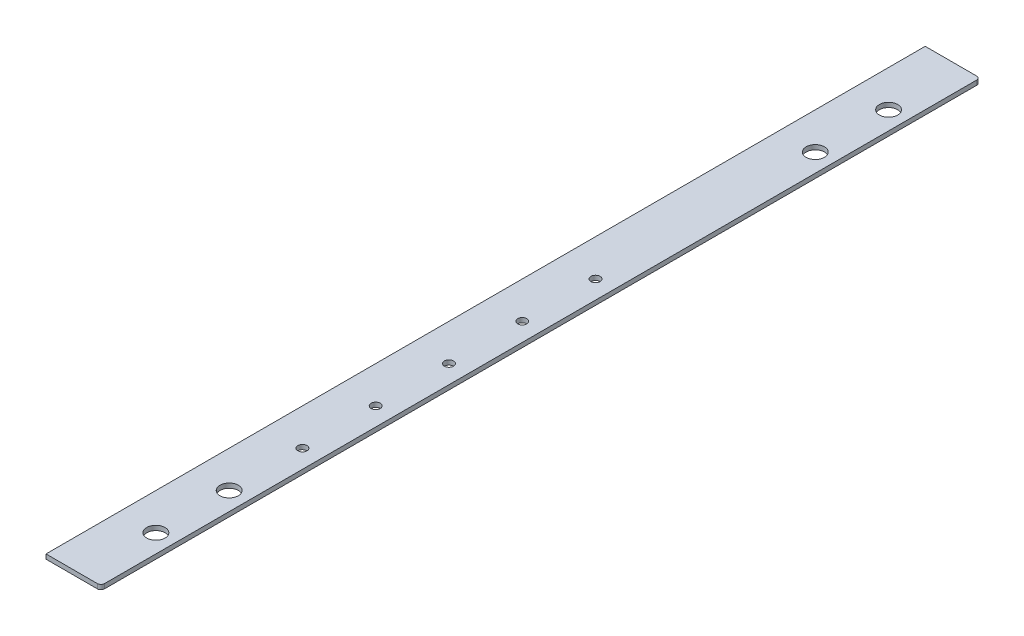
ISO-10303-21;
HEADER;
FILE_DESCRIPTION(('STEP AP214'),'2;1');
FILE_NAME('part.step','',(''),(''),'','','');
FILE_SCHEMA(('AUTOMOTIVE_DESIGN { 1 0 10303 214 1 1 1 1 }'));
ENDSEC;
DATA;
#1=APPLICATION_CONTEXT('core data for automotive mechanical design processes');
#2=APPLICATION_PROTOCOL_DEFINITION('international standard','automotive_design',2000,#1);
#3=PRODUCT_CONTEXT('',#1,'mechanical');
#4=PRODUCT('Part','Part','',(#3));
#5=PRODUCT_RELATED_PRODUCT_CATEGORY('part','',(#4));
#6=PRODUCT_DEFINITION_FORMATION('','',#4);
#7=PRODUCT_DEFINITION_CONTEXT('part definition',#1,'design');
#8=PRODUCT_DEFINITION('design','',#6,#7);
#9=PRODUCT_DEFINITION_SHAPE('','',#8);
#10=(LENGTH_UNIT() NAMED_UNIT(*) SI_UNIT(.MILLI.,.METRE.));
#11=(NAMED_UNIT(*) PLANE_ANGLE_UNIT() SI_UNIT($,.RADIAN.));
#12=(NAMED_UNIT(*) SI_UNIT($,.STERADIAN.) SOLID_ANGLE_UNIT());
#13=UNCERTAINTY_MEASURE_WITH_UNIT(LENGTH_MEASURE(1.E-05),#10,'distance_accuracy_value','');
#14=(GEOMETRIC_REPRESENTATION_CONTEXT(3) GLOBAL_UNCERTAINTY_ASSIGNED_CONTEXT((#13)) GLOBAL_UNIT_ASSIGNED_CONTEXT((#10,
#11,#12)) REPRESENTATION_CONTEXT('',''));
#15=CARTESIAN_POINT('',(0.,0.,0.));
#16=DIRECTION('',(0.,0.,1.));
#17=DIRECTION('',(1.,0.,0.));
#18=AXIS2_PLACEMENT_3D('',#15,#16,#17);
#19=CARTESIAN_POINT('',(0.,3.175,0.));
#20=DIRECTION('',(1.,0.,0.));
#21=DIRECTION('',(0.,0.,-1.));
#22=AXIS2_PLACEMENT_3D('',#19,#20,#21);
#23=PLANE('',#22);
#24=DIRECTION('',(0.,0.,1.));
#25=VECTOR('',#24,1.);
#26=CARTESIAN_POINT('',(0.,0.,0.));
#27=LINE('',#26,#25);
#28=CARTESIAN_POINT('',(-1.11022302462516E-13,0.,-609.6));
#29=VERTEX_POINT('',#28);
#30=CARTESIAN_POINT('',(0.,0.,0.));
#31=VERTEX_POINT('',#30);
#32=EDGE_CURVE('E105',#29,#31,#27,.T.);
#33=ORIENTED_EDGE('',*,*,#32,.T.);
#34=DIRECTION('',(0.,-1.,0.));
#35=VECTOR('',#34,1.);
#36=CARTESIAN_POINT('',(0.,3.175,0.));
#37=LINE('',#36,#35);
#38=CARTESIAN_POINT('',(0.,3.175,0.));
#39=VERTEX_POINT('',#38);
#40=EDGE_CURVE('E90',#39,#31,#37,.T.);
#41=ORIENTED_EDGE('',*,*,#40,.F.);
#42=DIRECTION('',(0.,0.,1.));
#43=VECTOR('',#42,1.);
#44=CARTESIAN_POINT('',(0.,3.175,0.));
#45=LINE('',#44,#43);
#46=CARTESIAN_POINT('',(-1.11022302462516E-13,3.175,-609.6));
#47=VERTEX_POINT('',#46);
#48=EDGE_CURVE('E94',#47,#39,#45,.T.);
#49=ORIENTED_EDGE('',*,*,#48,.F.);
#50=DIRECTION('',(0.,-1.,0.));
#51=VECTOR('',#50,1.);
#52=CARTESIAN_POINT('',(-1.11022302462516E-13,3.175,-609.6));
#53=LINE('',#52,#51);
#54=EDGE_CURVE('E107',#47,#29,#53,.T.);
#55=ORIENTED_EDGE('',*,*,#54,.T.);
#56=EDGE_LOOP('',(#33,#41,#49,#55));
#57=FACE_BOUND('',#56,.T.);
#58=ADVANCED_FACE('F33',(#57),#23,.F.);
#59=CARTESIAN_POINT('',(0.,3.175,0.));
#60=DIRECTION('',(0.,0.,-1.));
#61=DIRECTION('',(-1.,0.,0.));
#62=AXIS2_PLACEMENT_3D('',#59,#60,#61);
#63=PLANE('',#62);
#64=DIRECTION('',(1.,0.,0.));
#65=VECTOR('',#64,1.);
#66=CARTESIAN_POINT('',(0.,0.,0.));
#67=LINE('',#66,#65);
#68=CARTESIAN_POINT('',(35.56,0.,0.));
#69=VERTEX_POINT('',#68);
#70=EDGE_CURVE('E133',#31,#69,#67,.T.);
#71=ORIENTED_EDGE('',*,*,#70,.T.);
#72=DIRECTION('',(0.,-1.,0.));
#73=VECTOR('',#72,1.);
#74=CARTESIAN_POINT('',(35.56,3.175,0.));
#75=LINE('',#74,#73);
#76=CARTESIAN_POINT('',(35.56,3.175,0.));
#77=VERTEX_POINT('',#76);
#78=EDGE_CURVE('E56',#69,#77,#75,.F.);
#79=ORIENTED_EDGE('',*,*,#78,.T.);
#80=DIRECTION('',(1.,0.,0.));
#81=VECTOR('',#80,1.);
#82=CARTESIAN_POINT('',(0.,3.175,0.));
#83=LINE('',#82,#81);
#84=EDGE_CURVE('E86',#39,#77,#83,.T.);
#85=ORIENTED_EDGE('',*,*,#84,.F.);
#86=ORIENTED_EDGE('',*,*,#40,.T.);
#87=EDGE_LOOP('',(#71,#79,#85,#86));
#88=FACE_BOUND('',#87,.T.);
#89=ADVANCED_FACE('F88',(#88),#63,.F.);
#90=CARTESIAN_POINT('',(38.1,3.175,0.));
#91=DIRECTION('',(-1.,0.,0.));
#92=DIRECTION('',(0.,0.,1.));
#93=AXIS2_PLACEMENT_3D('',#90,#91,#92);
#94=PLANE('',#93);
#95=DIRECTION('',(0.,0.,-1.));
#96=VECTOR('',#95,1.);
#97=CARTESIAN_POINT('',(38.1,3.175,0.));
#98=LINE('',#97,#96);
#99=CARTESIAN_POINT('',(38.1,3.175,-2.54));
#100=VERTEX_POINT('',#99);
#101=CARTESIAN_POINT('',(38.0999999999999,3.175,-607.06));
#102=VERTEX_POINT('',#101);
#103=EDGE_CURVE('E93',#100,#102,#98,.T.);
#104=ORIENTED_EDGE('',*,*,#103,.F.);
#105=DIRECTION('',(0.,-1.,0.));
#106=VECTOR('',#105,1.);
#107=CARTESIAN_POINT('',(38.1,3.175,-2.54));
#108=LINE('',#107,#106);
#109=CARTESIAN_POINT('',(38.1,0.,-2.54));
#110=VERTEX_POINT('',#109);
#111=EDGE_CURVE('E109',#100,#110,#108,.T.);
#112=ORIENTED_EDGE('',*,*,#111,.T.);
#113=DIRECTION('',(0.,0.,-1.));
#114=VECTOR('',#113,1.);
#115=CARTESIAN_POINT('',(38.1,0.,0.));
#116=LINE('',#115,#114);
#117=CARTESIAN_POINT('',(38.0999999999999,0.,-607.06));
#118=VERTEX_POINT('',#117);
#119=EDGE_CURVE('E134',#110,#118,#116,.T.);
#120=ORIENTED_EDGE('',*,*,#119,.T.);
#121=DIRECTION('',(0.,-1.,0.));
#122=VECTOR('',#121,1.);
#123=CARTESIAN_POINT('',(38.0999999999999,3.175,-607.06));
#124=LINE('',#123,#122);
#125=EDGE_CURVE('E106',#118,#102,#124,.F.);
#126=ORIENTED_EDGE('',*,*,#125,.T.);
#127=EDGE_LOOP('',(#104,#112,#120,#126));
#128=FACE_BOUND('',#127,.T.);
#129=ADVANCED_FACE('F125',(#128),#94,.F.);
#130=CARTESIAN_POINT('',(-1.11022302462516E-13,3.175,-609.6));
#131=DIRECTION('',(0.,0.,1.));
#132=DIRECTION('',(1.,0.,0.));
#133=AXIS2_PLACEMENT_3D('',#130,#131,#132);
#134=PLANE('',#133);
#135=DIRECTION('',(-1.,0.,0.));
#136=VECTOR('',#135,1.);
#137=CARTESIAN_POINT('',(-1.11022302462516E-13,3.175,-609.6));
#138=LINE('',#137,#136);
#139=CARTESIAN_POINT('',(35.5599999999999,3.175,-609.6));
#140=VERTEX_POINT('',#139);
#141=EDGE_CURVE('E98',#140,#47,#138,.T.);
#142=ORIENTED_EDGE('',*,*,#141,.F.);
#143=DIRECTION('',(0.,-1.,0.));
#144=VECTOR('',#143,1.);
#145=CARTESIAN_POINT('',(35.5599999999999,3.175,-609.6));
#146=LINE('',#145,#144);
#147=CARTESIAN_POINT('',(35.5599999999999,0.,-609.6));
#148=VERTEX_POINT('',#147);
#149=EDGE_CURVE('E11',#140,#148,#146,.T.);
#150=ORIENTED_EDGE('',*,*,#149,.T.);
#151=DIRECTION('',(-1.,0.,0.));
#152=VECTOR('',#151,1.);
#153=CARTESIAN_POINT('',(-1.11022302462516E-13,0.,-609.6));
#154=LINE('',#153,#152);
#155=EDGE_CURVE('E102',#148,#29,#154,.T.);
#156=ORIENTED_EDGE('',*,*,#155,.T.);
#157=ORIENTED_EDGE('',*,*,#54,.F.);
#158=EDGE_LOOP('',(#142,#150,#156,#157));
#159=FACE_BOUND('',#158,.T.);
#160=ADVANCED_FACE('F142',(#159),#134,.F.);
#161=CARTESIAN_POINT('',(-1.11022302462516E-13,3.175,-609.6));
#162=DIRECTION('',(0.,-1.,0.));
#163=DIRECTION('',(0.,0.,-1.));
#164=AXIS2_PLACEMENT_3D('',#161,#162,#163);
#165=PLANE('',#164);
#166=CARTESIAN_POINT('',(25.3999999999999,3.175,-508.));
#167=DIRECTION('',(0.,1.,0.));
#168=DIRECTION('',(0.,0.,1.));
#169=AXIS2_PLACEMENT_3D('',#166,#167,#168);
#170=CIRCLE('',#169,6.35);
#171=CARTESIAN_POINT('',(25.3999999999999,3.175,-501.65));
#172=VERTEX_POINT('',#171);
#173=EDGE_CURVE('E209',#172,#172,#170,.T.);
#174=ORIENTED_EDGE('',*,*,#173,.F.);
#175=EDGE_LOOP('',(#174));
#176=FACE_BOUND('',#175,.T.);
#177=CARTESIAN_POINT('',(25.3999999999999,3.175,-558.8));
#178=DIRECTION('',(0.,1.,0.));
#179=DIRECTION('',(0.,0.,1.));
#180=AXIS2_PLACEMENT_3D('',#177,#178,#179);
#181=CIRCLE('',#180,6.35);
#182=CARTESIAN_POINT('',(25.3999999999999,3.175,-552.45));
#183=VERTEX_POINT('',#182);
#184=EDGE_CURVE('E211',#183,#183,#181,.T.);
#185=ORIENTED_EDGE('',*,*,#184,.F.);
#186=EDGE_LOOP('',(#185));
#187=FACE_BOUND('',#186,.T.);
#188=CARTESIAN_POINT('',(25.4,3.175,-101.6));
#189=DIRECTION('',(0.,1.,0.));
#190=DIRECTION('',(0.,0.,1.));
#191=AXIS2_PLACEMENT_3D('',#188,#189,#190);
#192=CIRCLE('',#191,6.35);
#193=CARTESIAN_POINT('',(25.4,3.175,-95.25));
#194=VERTEX_POINT('',#193);
#195=EDGE_CURVE('E217',#194,#194,#192,.T.);
#196=ORIENTED_EDGE('',*,*,#195,.F.);
#197=EDGE_LOOP('',(#196));
#198=FACE_BOUND('',#197,.T.);
#199=CARTESIAN_POINT('',(25.3999999999999,3.175,-355.6));
#200=DIRECTION('',(0.,1.,0.));
#201=DIRECTION('',(0.,0.,1.));
#202=AXIS2_PLACEMENT_3D('',#199,#200,#201);
#203=CIRCLE('',#202,3.175);
#204=CARTESIAN_POINT('',(25.3999999999999,3.175,-352.425));
#205=VERTEX_POINT('',#204);
#206=EDGE_CURVE('E223',#205,#205,#203,.T.);
#207=ORIENTED_EDGE('',*,*,#206,.F.);
#208=EDGE_LOOP('',(#207));
#209=FACE_BOUND('',#208,.T.);
#210=CARTESIAN_POINT('',(25.4,3.175,-304.8));
#211=DIRECTION('',(0.,1.,0.));
#212=DIRECTION('',(0.,0.,1.));
#213=AXIS2_PLACEMENT_3D('',#210,#211,#212);
#214=CIRCLE('',#213,3.175);
#215=CARTESIAN_POINT('',(25.4,3.175,-301.625));
#216=VERTEX_POINT('',#215);
#217=EDGE_CURVE('E229',#216,#216,#214,.T.);
#218=ORIENTED_EDGE('',*,*,#217,.F.);
#219=EDGE_LOOP('',(#218));
#220=FACE_BOUND('',#219,.T.);
#221=CARTESIAN_POINT('',(25.4,3.175,-254.));
#222=DIRECTION('',(0.,1.,0.));
#223=DIRECTION('',(0.,0.,1.));
#224=AXIS2_PLACEMENT_3D('',#221,#222,#223);
#225=CIRCLE('',#224,3.175);
#226=CARTESIAN_POINT('',(25.4,3.175,-250.825));
#227=VERTEX_POINT('',#226);
#228=EDGE_CURVE('E235',#227,#227,#225,.T.);
#229=ORIENTED_EDGE('',*,*,#228,.F.);
#230=EDGE_LOOP('',(#229));
#231=FACE_BOUND('',#230,.T.);
#232=CARTESIAN_POINT('',(25.4,3.175,-203.2));
#233=DIRECTION('',(0.,1.,0.));
#234=DIRECTION('',(0.,0.,1.));
#235=AXIS2_PLACEMENT_3D('',#232,#233,#234);
#236=CIRCLE('',#235,3.175);
#237=CARTESIAN_POINT('',(25.4,3.175,-200.025));
#238=VERTEX_POINT('',#237);
#239=EDGE_CURVE('E241',#238,#238,#236,.T.);
#240=ORIENTED_EDGE('',*,*,#239,.F.);
#241=EDGE_LOOP('',(#240));
#242=FACE_BOUND('',#241,.T.);
#243=CARTESIAN_POINT('',(25.4,3.175,-152.4));
#244=DIRECTION('',(0.,1.,0.));
#245=DIRECTION('',(0.,0.,1.));
#246=AXIS2_PLACEMENT_3D('',#243,#244,#245);
#247=CIRCLE('',#246,3.175);
#248=CARTESIAN_POINT('',(25.4,3.175,-149.225));
#249=VERTEX_POINT('',#248);
#250=EDGE_CURVE('E247',#249,#249,#247,.T.);
#251=ORIENTED_EDGE('',*,*,#250,.F.);
#252=EDGE_LOOP('',(#251));
#253=FACE_BOUND('',#252,.T.);
#254=CARTESIAN_POINT('',(25.4,3.175,-50.8));
#255=DIRECTION('',(0.,1.,0.));
#256=DIRECTION('',(0.,0.,1.));
#257=AXIS2_PLACEMENT_3D('',#254,#255,#256);
#258=CIRCLE('',#257,6.35);
#259=CARTESIAN_POINT('',(25.4,3.175,-44.45));
#260=VERTEX_POINT('',#259);
#261=EDGE_CURVE('E253',#260,#260,#258,.T.);
#262=ORIENTED_EDGE('',*,*,#261,.F.);
#263=EDGE_LOOP('',(#262));
#264=FACE_BOUND('',#263,.T.);
#265=ORIENTED_EDGE('',*,*,#84,.T.);
#266=CARTESIAN_POINT('',(35.56,3.175,-2.54));
#267=DIRECTION('',(0.,-1.,0.));
#268=DIRECTION('',(0.,0.,-1.));
#269=AXIS2_PLACEMENT_3D('',#266,#267,#268);
#270=CIRCLE('',#269,2.54);
#271=EDGE_CURVE('E41',#77,#100,#270,.F.);
#272=ORIENTED_EDGE('',*,*,#271,.T.);
#273=ORIENTED_EDGE('',*,*,#103,.T.);
#274=CARTESIAN_POINT('',(35.5599999999999,3.175,-607.06));
#275=DIRECTION('',(0.,-1.,0.));
#276=DIRECTION('',(0.,0.,-1.));
#277=AXIS2_PLACEMENT_3D('',#274,#275,#276);
#278=CIRCLE('',#277,2.54);
#279=EDGE_CURVE('E48',#102,#140,#278,.F.);
#280=ORIENTED_EDGE('',*,*,#279,.T.);
#281=ORIENTED_EDGE('',*,*,#141,.T.);
#282=ORIENTED_EDGE('',*,*,#48,.T.);
#283=EDGE_LOOP('',(#265,#272,#273,#280,#281,#282));
#284=FACE_BOUND('',#283,.T.);
#285=ADVANCED_FACE('F97',(#176,#187,#198,#209,#220,#231,#242,#253,#264,#284),#165,.F.);
#286=CARTESIAN_POINT('',(-1.11022302462516E-13,0.,-609.6));
#287=DIRECTION('',(0.,-1.,0.));
#288=DIRECTION('',(0.,0.,-1.));
#289=AXIS2_PLACEMENT_3D('',#286,#287,#288);
#290=PLANE('',#289);
#291=CARTESIAN_POINT('',(25.3999999999999,0.,-508.));
#292=DIRECTION('',(0.,1.,0.));
#293=DIRECTION('',(0.,0.,1.));
#294=AXIS2_PLACEMENT_3D('',#291,#292,#293);
#295=CIRCLE('',#294,6.35);
#296=CARTESIAN_POINT('',(25.3999999999999,0.,-501.65));
#297=VERTEX_POINT('',#296);
#298=EDGE_CURVE('E206',#297,#297,#295,.T.);
#299=ORIENTED_EDGE('',*,*,#298,.T.);
#300=EDGE_LOOP('',(#299));
#301=FACE_BOUND('',#300,.T.);
#302=CARTESIAN_POINT('',(25.3999999999999,0.,-558.8));
#303=DIRECTION('',(0.,1.,0.));
#304=DIRECTION('',(0.,0.,1.));
#305=AXIS2_PLACEMENT_3D('',#302,#303,#304);
#306=CIRCLE('',#305,6.35);
#307=CARTESIAN_POINT('',(25.3999999999999,0.,-552.45));
#308=VERTEX_POINT('',#307);
#309=EDGE_CURVE('E214',#308,#308,#306,.T.);
#310=ORIENTED_EDGE('',*,*,#309,.T.);
#311=EDGE_LOOP('',(#310));
#312=FACE_BOUND('',#311,.T.);
#313=CARTESIAN_POINT('',(25.4,0.,-101.6));
#314=DIRECTION('',(0.,1.,0.));
#315=DIRECTION('',(0.,0.,1.));
#316=AXIS2_PLACEMENT_3D('',#313,#314,#315);
#317=CIRCLE('',#316,6.35);
#318=CARTESIAN_POINT('',(25.4,0.,-95.25));
#319=VERTEX_POINT('',#318);
#320=EDGE_CURVE('E220',#319,#319,#317,.T.);
#321=ORIENTED_EDGE('',*,*,#320,.T.);
#322=EDGE_LOOP('',(#321));
#323=FACE_BOUND('',#322,.T.);
#324=CARTESIAN_POINT('',(25.3999999999999,0.,-355.6));
#325=DIRECTION('',(0.,1.,0.));
#326=DIRECTION('',(0.,0.,1.));
#327=AXIS2_PLACEMENT_3D('',#324,#325,#326);
#328=CIRCLE('',#327,3.175);
#329=CARTESIAN_POINT('',(25.3999999999999,0.,-352.425));
#330=VERTEX_POINT('',#329);
#331=EDGE_CURVE('E226',#330,#330,#328,.T.);
#332=ORIENTED_EDGE('',*,*,#331,.T.);
#333=EDGE_LOOP('',(#332));
#334=FACE_BOUND('',#333,.T.);
#335=CARTESIAN_POINT('',(25.4,0.,-304.8));
#336=DIRECTION('',(0.,1.,0.));
#337=DIRECTION('',(0.,0.,1.));
#338=AXIS2_PLACEMENT_3D('',#335,#336,#337);
#339=CIRCLE('',#338,3.175);
#340=CARTESIAN_POINT('',(25.4,0.,-301.625));
#341=VERTEX_POINT('',#340);
#342=EDGE_CURVE('E232',#341,#341,#339,.T.);
#343=ORIENTED_EDGE('',*,*,#342,.T.);
#344=EDGE_LOOP('',(#343));
#345=FACE_BOUND('',#344,.T.);
#346=CARTESIAN_POINT('',(25.4,0.,-254.));
#347=DIRECTION('',(0.,1.,0.));
#348=DIRECTION('',(0.,0.,1.));
#349=AXIS2_PLACEMENT_3D('',#346,#347,#348);
#350=CIRCLE('',#349,3.175);
#351=CARTESIAN_POINT('',(25.4,0.,-250.825));
#352=VERTEX_POINT('',#351);
#353=EDGE_CURVE('E238',#352,#352,#350,.T.);
#354=ORIENTED_EDGE('',*,*,#353,.T.);
#355=EDGE_LOOP('',(#354));
#356=FACE_BOUND('',#355,.T.);
#357=CARTESIAN_POINT('',(25.4,0.,-203.2));
#358=DIRECTION('',(0.,1.,0.));
#359=DIRECTION('',(0.,0.,1.));
#360=AXIS2_PLACEMENT_3D('',#357,#358,#359);
#361=CIRCLE('',#360,3.175);
#362=CARTESIAN_POINT('',(25.4,0.,-200.025));
#363=VERTEX_POINT('',#362);
#364=EDGE_CURVE('E244',#363,#363,#361,.T.);
#365=ORIENTED_EDGE('',*,*,#364,.T.);
#366=EDGE_LOOP('',(#365));
#367=FACE_BOUND('',#366,.T.);
#368=CARTESIAN_POINT('',(25.4,0.,-152.4));
#369=DIRECTION('',(0.,1.,0.));
#370=DIRECTION('',(0.,0.,1.));
#371=AXIS2_PLACEMENT_3D('',#368,#369,#370);
#372=CIRCLE('',#371,3.175);
#373=CARTESIAN_POINT('',(25.4,0.,-149.225));
#374=VERTEX_POINT('',#373);
#375=EDGE_CURVE('E250',#374,#374,#372,.T.);
#376=ORIENTED_EDGE('',*,*,#375,.T.);
#377=EDGE_LOOP('',(#376));
#378=FACE_BOUND('',#377,.T.);
#379=CARTESIAN_POINT('',(25.4,0.,-50.8));
#380=DIRECTION('',(0.,1.,0.));
#381=DIRECTION('',(0.,0.,1.));
#382=AXIS2_PLACEMENT_3D('',#379,#380,#381);
#383=CIRCLE('',#382,6.35);
#384=CARTESIAN_POINT('',(25.4,0.,-44.45));
#385=VERTEX_POINT('',#384);
#386=EDGE_CURVE('E137',#385,#385,#383,.T.);
#387=ORIENTED_EDGE('',*,*,#386,.T.);
#388=EDGE_LOOP('',(#387));
#389=FACE_BOUND('',#388,.T.);
#390=ORIENTED_EDGE('',*,*,#119,.F.);
#391=CARTESIAN_POINT('',(35.56,0.,-2.54));
#392=DIRECTION('',(0.,-1.,0.));
#393=DIRECTION('',(0.,0.,-1.));
#394=AXIS2_PLACEMENT_3D('',#391,#392,#393);
#395=CIRCLE('',#394,2.54);
#396=EDGE_CURVE('E118',#110,#69,#395,.T.);
#397=ORIENTED_EDGE('',*,*,#396,.T.);
#398=ORIENTED_EDGE('',*,*,#70,.F.);
#399=ORIENTED_EDGE('',*,*,#32,.F.);
#400=ORIENTED_EDGE('',*,*,#155,.F.);
#401=CARTESIAN_POINT('',(35.5599999999999,0.,-607.06));
#402=DIRECTION('',(0.,-1.,0.));
#403=DIRECTION('',(0.,0.,-1.));
#404=AXIS2_PLACEMENT_3D('',#401,#402,#403);
#405=CIRCLE('',#404,2.54);
#406=EDGE_CURVE('E116',#148,#118,#405,.T.);
#407=ORIENTED_EDGE('',*,*,#406,.T.);
#408=EDGE_LOOP('',(#390,#397,#398,#399,#400,#407));
#409=FACE_BOUND('',#408,.T.);
#410=ADVANCED_FACE('F132',(#301,#312,#323,#334,#345,#356,#367,#378,#389,#409),#290,.T.);
#411=CARTESIAN_POINT('',(35.56,3.175,-2.54));
#412=DIRECTION('',(0.,-1.,0.));
#413=DIRECTION('',(0.,0.,-1.));
#414=AXIS2_PLACEMENT_3D('',#411,#412,#413);
#415=CYLINDRICAL_SURFACE('',#414,2.54);
#416=ORIENTED_EDGE('',*,*,#271,.F.);
#417=ORIENTED_EDGE('',*,*,#78,.F.);
#418=ORIENTED_EDGE('',*,*,#396,.F.);
#419=ORIENTED_EDGE('',*,*,#111,.F.);
#420=EDGE_LOOP('',(#416,#417,#418,#419));
#421=FACE_BOUND('',#420,.T.);
#422=ADVANCED_FACE('F130',(#421),#415,.T.);
#423=CARTESIAN_POINT('',(35.5599999999999,3.175,-607.06));
#424=DIRECTION('',(0.,-1.,0.));
#425=DIRECTION('',(0.,0.,-1.));
#426=AXIS2_PLACEMENT_3D('',#423,#424,#425);
#427=CYLINDRICAL_SURFACE('',#426,2.54);
#428=ORIENTED_EDGE('',*,*,#279,.F.);
#429=ORIENTED_EDGE('',*,*,#125,.F.);
#430=ORIENTED_EDGE('',*,*,#406,.F.);
#431=ORIENTED_EDGE('',*,*,#149,.F.);
#432=EDGE_LOOP('',(#428,#429,#430,#431));
#433=FACE_BOUND('',#432,.T.);
#434=ADVANCED_FACE('F35',(#433),#427,.T.);
#435=CARTESIAN_POINT('',(25.4,0.,-50.8));
#436=DIRECTION('',(0.,1.,0.));
#437=DIRECTION('',(0.,0.,1.));
#438=AXIS2_PLACEMENT_3D('',#435,#436,#437);
#439=CYLINDRICAL_SURFACE('',#438,6.35);
#440=ORIENTED_EDGE('',*,*,#386,.F.);
#441=EDGE_LOOP('',(#440));
#442=FACE_BOUND('',#441,.T.);
#443=ORIENTED_EDGE('',*,*,#261,.T.);
#444=EDGE_LOOP('',(#443));
#445=FACE_BOUND('',#444,.T.);
#446=ADVANCED_FACE('F146',(#442,#445),#439,.F.);
#447=CARTESIAN_POINT('',(25.4,0.,-152.4));
#448=DIRECTION('',(0.,1.,0.));
#449=DIRECTION('',(0.,0.,1.));
#450=AXIS2_PLACEMENT_3D('',#447,#448,#449);
#451=CYLINDRICAL_SURFACE('',#450,3.175);
#452=ORIENTED_EDGE('',*,*,#375,.F.);
#453=EDGE_LOOP('',(#452));
#454=FACE_BOUND('',#453,.T.);
#455=ORIENTED_EDGE('',*,*,#250,.T.);
#456=EDGE_LOOP('',(#455));
#457=FACE_BOUND('',#456,.T.);
#458=ADVANCED_FACE('F151',(#454,#457),#451,.F.);
#459=CARTESIAN_POINT('',(25.4,0.,-203.2));
#460=DIRECTION('',(0.,1.,0.));
#461=DIRECTION('',(0.,0.,1.));
#462=AXIS2_PLACEMENT_3D('',#459,#460,#461);
#463=CYLINDRICAL_SURFACE('',#462,3.175);
#464=ORIENTED_EDGE('',*,*,#364,.F.);
#465=EDGE_LOOP('',(#464));
#466=FACE_BOUND('',#465,.T.);
#467=ORIENTED_EDGE('',*,*,#239,.T.);
#468=EDGE_LOOP('',(#467));
#469=FACE_BOUND('',#468,.T.);
#470=ADVANCED_FACE('F173',(#466,#469),#463,.F.);
#471=CARTESIAN_POINT('',(25.4,0.,-254.));
#472=DIRECTION('',(0.,1.,0.));
#473=DIRECTION('',(0.,0.,1.));
#474=AXIS2_PLACEMENT_3D('',#471,#472,#473);
#475=CYLINDRICAL_SURFACE('',#474,3.175);
#476=ORIENTED_EDGE('',*,*,#353,.F.);
#477=EDGE_LOOP('',(#476));
#478=FACE_BOUND('',#477,.T.);
#479=ORIENTED_EDGE('',*,*,#228,.T.);
#480=EDGE_LOOP('',(#479));
#481=FACE_BOUND('',#480,.T.);
#482=ADVANCED_FACE('F177',(#478,#481),#475,.F.);
#483=CARTESIAN_POINT('',(25.4,0.,-304.8));
#484=DIRECTION('',(0.,1.,0.));
#485=DIRECTION('',(0.,0.,1.));
#486=AXIS2_PLACEMENT_3D('',#483,#484,#485);
#487=CYLINDRICAL_SURFACE('',#486,3.175);
#488=ORIENTED_EDGE('',*,*,#342,.F.);
#489=EDGE_LOOP('',(#488));
#490=FACE_BOUND('',#489,.T.);
#491=ORIENTED_EDGE('',*,*,#217,.T.);
#492=EDGE_LOOP('',(#491));
#493=FACE_BOUND('',#492,.T.);
#494=ADVANCED_FACE('F181',(#490,#493),#487,.F.);
#495=CARTESIAN_POINT('',(25.3999999999999,0.,-355.6));
#496=DIRECTION('',(0.,1.,0.));
#497=DIRECTION('',(0.,0.,1.));
#498=AXIS2_PLACEMENT_3D('',#495,#496,#497);
#499=CYLINDRICAL_SURFACE('',#498,3.175);
#500=ORIENTED_EDGE('',*,*,#331,.F.);
#501=EDGE_LOOP('',(#500));
#502=FACE_BOUND('',#501,.T.);
#503=ORIENTED_EDGE('',*,*,#206,.T.);
#504=EDGE_LOOP('',(#503));
#505=FACE_BOUND('',#504,.T.);
#506=ADVANCED_FACE('F185',(#502,#505),#499,.F.);
#507=CARTESIAN_POINT('',(25.4,0.,-101.6));
#508=DIRECTION('',(0.,1.,0.));
#509=DIRECTION('',(0.,0.,1.));
#510=AXIS2_PLACEMENT_3D('',#507,#508,#509);
#511=CYLINDRICAL_SURFACE('',#510,6.35);
#512=ORIENTED_EDGE('',*,*,#320,.F.);
#513=EDGE_LOOP('',(#512));
#514=FACE_BOUND('',#513,.T.);
#515=ORIENTED_EDGE('',*,*,#195,.T.);
#516=EDGE_LOOP('',(#515));
#517=FACE_BOUND('',#516,.T.);
#518=ADVANCED_FACE('F189',(#514,#517),#511,.F.);
#519=CARTESIAN_POINT('',(25.3999999999999,0.,-558.8));
#520=DIRECTION('',(0.,1.,0.));
#521=DIRECTION('',(0.,0.,1.));
#522=AXIS2_PLACEMENT_3D('',#519,#520,#521);
#523=CYLINDRICAL_SURFACE('',#522,6.35);
#524=ORIENTED_EDGE('',*,*,#309,.F.);
#525=EDGE_LOOP('',(#524));
#526=FACE_BOUND('',#525,.T.);
#527=ORIENTED_EDGE('',*,*,#184,.T.);
#528=EDGE_LOOP('',(#527));
#529=FACE_BOUND('',#528,.T.);
#530=ADVANCED_FACE('F193',(#526,#529),#523,.F.);
#531=CARTESIAN_POINT('',(25.3999999999999,0.,-508.));
#532=DIRECTION('',(0.,1.,0.));
#533=DIRECTION('',(0.,0.,1.));
#534=AXIS2_PLACEMENT_3D('',#531,#532,#533);
#535=CYLINDRICAL_SURFACE('',#534,6.35);
#536=ORIENTED_EDGE('',*,*,#298,.F.);
#537=EDGE_LOOP('',(#536));
#538=FACE_BOUND('',#537,.T.);
#539=ORIENTED_EDGE('',*,*,#173,.T.);
#540=EDGE_LOOP('',(#539));
#541=FACE_BOUND('',#540,.T.);
#542=ADVANCED_FACE('F197',(#538,#541),#535,.F.);
#543=CLOSED_SHELL('',(#58,#89,#129,#160,#285,#410,#422,#434,#446,#458,#470,#482,#494,#506,#518,
#530,#542));
#544=MANIFOLD_SOLID_BREP('B2',#543);
#545=ADVANCED_BREP_SHAPE_REPRESENTATION('',(#18,#544),#14);
#546=SHAPE_DEFINITION_REPRESENTATION(#9,#545);
ENDSEC;
END-ISO-10303-21;
